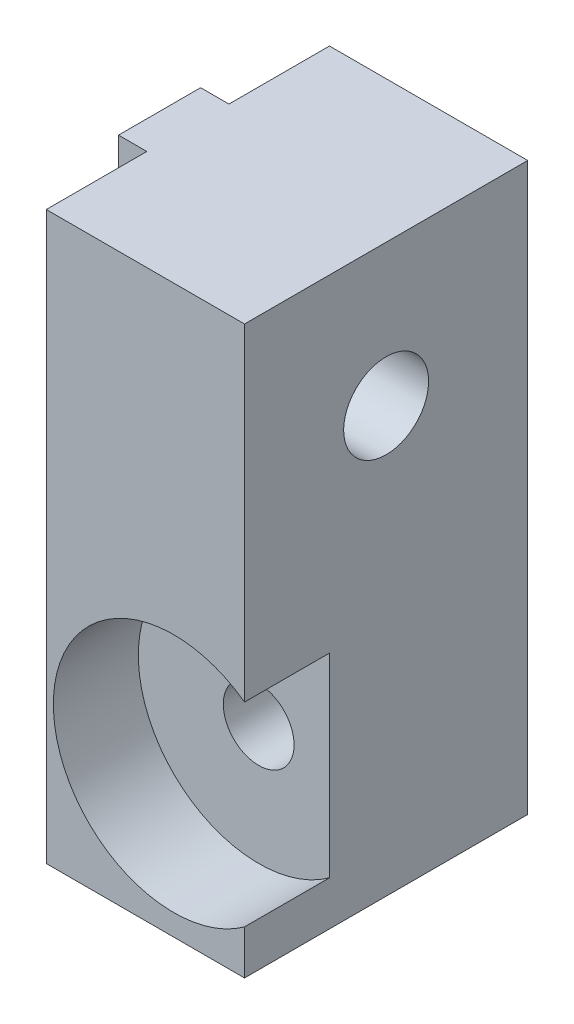
ISO-10303-21;
HEADER;
FILE_DESCRIPTION(('STEP AP214'),'2;1');
FILE_NAME('part.step','',(''),(''),'','','');
FILE_SCHEMA(('AUTOMOTIVE_DESIGN { 1 0 10303 214 1 1 1 1 }'));
ENDSEC;
DATA;
#1=APPLICATION_CONTEXT('core data for automotive mechanical design processes');
#2=APPLICATION_PROTOCOL_DEFINITION('international standard','automotive_design',2000,#1);
#3=PRODUCT_CONTEXT('',#1,'mechanical');
#4=PRODUCT('Part','Part','',(#3));
#5=PRODUCT_RELATED_PRODUCT_CATEGORY('part','',(#4));
#6=PRODUCT_DEFINITION_FORMATION('','',#4);
#7=PRODUCT_DEFINITION_CONTEXT('part definition',#1,'design');
#8=PRODUCT_DEFINITION('design','',#6,#7);
#9=PRODUCT_DEFINITION_SHAPE('','',#8);
#10=(LENGTH_UNIT() NAMED_UNIT(*) SI_UNIT(.MILLI.,.METRE.));
#11=(NAMED_UNIT(*) PLANE_ANGLE_UNIT() SI_UNIT($,.RADIAN.));
#12=(NAMED_UNIT(*) SI_UNIT($,.STERADIAN.) SOLID_ANGLE_UNIT());
#13=UNCERTAINTY_MEASURE_WITH_UNIT(LENGTH_MEASURE(1.E-05),#10,'distance_accuracy_value','');
#14=(GEOMETRIC_REPRESENTATION_CONTEXT(3) GLOBAL_UNCERTAINTY_ASSIGNED_CONTEXT((#13)) GLOBAL_UNIT_ASSIGNED_CONTEXT((#10,
#11,#12)) REPRESENTATION_CONTEXT('',''));
#15=CARTESIAN_POINT('',(0.,0.,0.));
#16=DIRECTION('',(0.,0.,1.));
#17=DIRECTION('',(1.,0.,0.));
#18=AXIS2_PLACEMENT_3D('',#15,#16,#17);
#19=CARTESIAN_POINT('',(4.5,5.,0.));
#20=DIRECTION('',(0.,0.,1.));
#21=DIRECTION('',(1.,0.,0.));
#22=AXIS2_PLACEMENT_3D('',#19,#20,#21);
#23=CYLINDRICAL_SURFACE('',#22,1.25);
#24=CARTESIAN_POINT('',(4.5,5.,0.));
#25=DIRECTION('',(0.,0.,1.));
#26=DIRECTION('',(1.,0.,0.));
#27=AXIS2_PLACEMENT_3D('',#24,#25,#26);
#28=CIRCLE('',#27,1.25);
#29=CARTESIAN_POINT('',(5.75,5.,0.));
#30=VERTEX_POINT('',#29);
#31=EDGE_CURVE('E149',#30,#30,#28,.T.);
#32=ORIENTED_EDGE('',*,*,#31,.F.);
#33=EDGE_LOOP('',(#32));
#34=FACE_BOUND('',#33,.T.);
#35=CARTESIAN_POINT('',(4.5,5.,7.));
#36=DIRECTION('',(0.,0.,1.));
#37=DIRECTION('',(1.,0.,0.));
#38=AXIS2_PLACEMENT_3D('',#35,#36,#37);
#39=CIRCLE('',#38,1.25);
#40=CARTESIAN_POINT('',(5.75,5.,7.));
#41=VERTEX_POINT('',#40);
#42=EDGE_CURVE('E37',#41,#41,#39,.F.);
#43=ORIENTED_EDGE('',*,*,#42,.F.);
#44=EDGE_LOOP('',(#43));
#45=FACE_BOUND('',#44,.T.);
#46=ADVANCED_FACE('F33',(#34,#45),#23,.F.);
#47=CARTESIAN_POINT('',(-1.,20.,3.55));
#48=DIRECTION('',(0.,0.,1.));
#49=DIRECTION('',(0.,-1.,0.));
#50=AXIS2_PLACEMENT_3D('',#47,#48,#49);
#51=PLANE('',#50);
#52=DIRECTION('',(0.,-1.,0.));
#53=VECTOR('',#52,1.);
#54=CARTESIAN_POINT('',(0.,20.,3.55));
#55=LINE('',#54,#53);
#56=CARTESIAN_POINT('',(0.,20.,3.55));
#57=VERTEX_POINT('',#56);
#58=CARTESIAN_POINT('',(0.,15.3840572873934,3.55));
#59=VERTEX_POINT('',#58);
#60=EDGE_CURVE('E214',#57,#59,#55,.T.);
#61=ORIENTED_EDGE('',*,*,#60,.T.);
#62=DIRECTION('',(-1.,0.,0.));
#63=VECTOR('',#62,1.);
#64=CARTESIAN_POINT('',(7.00000000000001,15.3840572873934,3.55));
#65=LINE('',#64,#63);
#66=CARTESIAN_POINT('',(-1.,15.3840572873934,3.55));
#67=VERTEX_POINT('',#66);
#68=EDGE_CURVE('E265',#59,#67,#65,.T.);
#69=ORIENTED_EDGE('',*,*,#68,.T.);
#70=DIRECTION('',(0.,-1.,0.));
#71=VECTOR('',#70,1.);
#72=CARTESIAN_POINT('',(-1.,20.,3.55));
#73=LINE('',#72,#71);
#74=CARTESIAN_POINT('',(-1.,20.,3.55));
#75=VERTEX_POINT('',#74);
#76=EDGE_CURVE('E267',#75,#67,#73,.T.);
#77=ORIENTED_EDGE('',*,*,#76,.F.);
#78=DIRECTION('',(1.,0.,0.));
#79=VECTOR('',#78,1.);
#80=CARTESIAN_POINT('',(-1.,20.,3.55));
#81=LINE('',#80,#79);
#82=EDGE_CURVE('E209',#75,#57,#81,.T.);
#83=ORIENTED_EDGE('',*,*,#82,.T.);
#84=EDGE_LOOP('',(#61,#69,#77,#83));
#85=FACE_BOUND('',#84,.T.);
#86=ADVANCED_FACE('F279',(#85),#51,.F.);
#87=CARTESIAN_POINT('',(-1.,20.,6.45));
#88=DIRECTION('',(0.,0.,-1.));
#89=DIRECTION('',(0.,1.,0.));
#90=AXIS2_PLACEMENT_3D('',#87,#88,#89);
#91=PLANE('',#90);
#92=DIRECTION('',(0.,1.,0.));
#93=VECTOR('',#92,1.);
#94=CARTESIAN_POINT('',(0.,20.,6.45));
#95=LINE('',#94,#93);
#96=CARTESIAN_POINT('',(0.,0.,6.45));
#97=VERTEX_POINT('',#96);
#98=CARTESIAN_POINT('',(0.,14.6159427126066,6.45));
#99=VERTEX_POINT('',#98);
#100=EDGE_CURVE('E199',#97,#99,#95,.T.);
#101=ORIENTED_EDGE('',*,*,#100,.T.);
#102=DIRECTION('',(-1.,0.,0.));
#103=VECTOR('',#102,1.);
#104=CARTESIAN_POINT('',(7.00000000000001,14.6159427126066,6.45));
#105=LINE('',#104,#103);
#106=CARTESIAN_POINT('',(-1.,14.6159427126066,6.45));
#107=VERTEX_POINT('',#106);
#108=EDGE_CURVE('E188',#99,#107,#105,.T.);
#109=ORIENTED_EDGE('',*,*,#108,.T.);
#110=DIRECTION('',(0.,1.,0.));
#111=VECTOR('',#110,1.);
#112=CARTESIAN_POINT('',(-1.,20.,6.45));
#113=LINE('',#112,#111);
#114=CARTESIAN_POINT('',(-1.,0.,6.45000000000001));
#115=VERTEX_POINT('',#114);
#116=EDGE_CURVE('E198',#115,#107,#113,.T.);
#117=ORIENTED_EDGE('',*,*,#116,.F.);
#118=DIRECTION('',(1.,0.,0.));
#119=VECTOR('',#118,1.);
#120=CARTESIAN_POINT('',(-1.,0.,6.45000000000001));
#121=LINE('',#120,#119);
#122=EDGE_CURVE('E226',#115,#97,#121,.T.);
#123=ORIENTED_EDGE('',*,*,#122,.T.);
#124=EDGE_LOOP('',(#101,#109,#117,#123));
#125=FACE_BOUND('',#124,.T.);
#126=ADVANCED_FACE('F196',(#125),#91,.F.);
#127=CARTESIAN_POINT('',(-1.,0.,0.));
#128=DIRECTION('',(-1.,0.,0.));
#129=DIRECTION('',(0.,-1.,0.));
#130=AXIS2_PLACEMENT_3D('',#127,#128,#129);
#131=PLANE('',#130);
#132=CARTESIAN_POINT('',(-1.,15.,5.));
#133=DIRECTION('',(-1.,0.,0.));
#134=DIRECTION('',(0.,-1.,0.));
#135=AXIS2_PLACEMENT_3D('',#132,#133,#134);
#136=CIRCLE('',#135,1.5);
#137=CARTESIAN_POINT('',(-1.,15.3840572873934,6.45));
#138=VERTEX_POINT('',#137);
#139=EDGE_CURVE('E11',#138,#67,#136,.T.);
#140=ORIENTED_EDGE('',*,*,#139,.F.);
#141=CARTESIAN_POINT('',(-1.,20.,6.45));
#142=VERTEX_POINT('',#141);
#143=EDGE_CURVE('E207',#138,#142,#113,.T.);
#144=ORIENTED_EDGE('',*,*,#143,.T.);
#145=DIRECTION('',(0.,0.,-1.));
#146=VECTOR('',#145,1.);
#147=CARTESIAN_POINT('',(-1.,20.,3.55));
#148=LINE('',#147,#146);
#149=EDGE_CURVE('E206',#142,#75,#148,.T.);
#150=ORIENTED_EDGE('',*,*,#149,.T.);
#151=ORIENTED_EDGE('',*,*,#76,.T.);
#152=EDGE_LOOP('',(#140,#144,#150,#151));
#153=FACE_BOUND('',#152,.T.);
#154=ADVANCED_FACE('F282',(#153),#131,.T.);
#155=CARTESIAN_POINT('',(0.,20.,10.));
#156=DIRECTION('',(1.,0.,0.));
#157=DIRECTION('',(0.,1.,0.));
#158=AXIS2_PLACEMENT_3D('',#155,#156,#157);
#159=PLANE('',#158);
#160=CARTESIAN_POINT('',(0.,14.6159427126066,3.55));
#161=VERTEX_POINT('',#160);
#162=CARTESIAN_POINT('',(0.,0.,3.55));
#163=VERTEX_POINT('',#162);
#164=EDGE_CURVE('E218',#161,#163,#55,.T.);
#165=ORIENTED_EDGE('',*,*,#164,.F.);
#166=CARTESIAN_POINT('',(0.,15.,5.));
#167=DIRECTION('',(1.,0.,0.));
#168=DIRECTION('',(0.,1.,0.));
#169=AXIS2_PLACEMENT_3D('',#166,#167,#168);
#170=CIRCLE('',#169,1.5);
#171=EDGE_CURVE('E262',#161,#59,#170,.T.);
#172=ORIENTED_EDGE('',*,*,#171,.T.);
#173=ORIENTED_EDGE('',*,*,#60,.F.);
#174=DIRECTION('',(0.,0.,-1.));
#175=VECTOR('',#174,1.);
#176=CARTESIAN_POINT('',(0.,20.,10.));
#177=LINE('',#176,#175);
#178=CARTESIAN_POINT('',(0.,20.,0.));
#179=VERTEX_POINT('',#178);
#180=EDGE_CURVE('E158',#57,#179,#177,.T.);
#181=ORIENTED_EDGE('',*,*,#180,.T.);
#182=DIRECTION('',(0.,-1.,0.));
#183=VECTOR('',#182,1.);
#184=CARTESIAN_POINT('',(0.,20.,0.));
#185=LINE('',#184,#183);
#186=CARTESIAN_POINT('',(0.,0.,0.));
#187=VERTEX_POINT('',#186);
#188=EDGE_CURVE('E163',#179,#187,#185,.T.);
#189=ORIENTED_EDGE('',*,*,#188,.T.);
#190=DIRECTION('',(0.,0.,-1.));
#191=VECTOR('',#190,1.);
#192=CARTESIAN_POINT('',(0.,0.,10.));
#193=LINE('',#192,#191);
#194=EDGE_CURVE('E183',#163,#187,#193,.T.);
#195=ORIENTED_EDGE('',*,*,#194,.F.);
#196=EDGE_LOOP('',(#165,#172,#173,#181,#189,#195));
#197=FACE_BOUND('',#196,.T.);
#198=ADVANCED_FACE('F35',(#197),#159,.F.);
#199=CARTESIAN_POINT('',(0.,15.3840572873934,6.45));
#200=VERTEX_POINT('',#199);
#201=CARTESIAN_POINT('',(0.,20.,6.45));
#202=VERTEX_POINT('',#201);
#203=EDGE_CURVE('E217',#200,#202,#95,.T.);
#204=ORIENTED_EDGE('',*,*,#203,.F.);
#205=CARTESIAN_POINT('',(0.,15.,5.));
#206=DIRECTION('',(1.,0.,0.));
#207=DIRECTION('',(0.,1.,0.));
#208=AXIS2_PLACEMENT_3D('',#205,#206,#207);
#209=CIRCLE('',#208,1.5);
#210=EDGE_CURVE('E200',#200,#99,#209,.T.);
#211=ORIENTED_EDGE('',*,*,#210,.T.);
#212=ORIENTED_EDGE('',*,*,#100,.F.);
#213=CARTESIAN_POINT('',(0.,0.,10.));
#214=VERTEX_POINT('',#213);
#215=EDGE_CURVE('E184',#214,#97,#193,.T.);
#216=ORIENTED_EDGE('',*,*,#215,.F.);
#217=DIRECTION('',(0.,-1.,0.));
#218=VECTOR('',#217,1.);
#219=CARTESIAN_POINT('',(0.,20.,10.));
#220=LINE('',#219,#218);
#221=CARTESIAN_POINT('',(0.,20.,10.));
#222=VERTEX_POINT('',#221);
#223=EDGE_CURVE('E174',#222,#214,#220,.T.);
#224=ORIENTED_EDGE('',*,*,#223,.F.);
#225=EDGE_CURVE('E175',#222,#202,#177,.T.);
#226=ORIENTED_EDGE('',*,*,#225,.T.);
#227=EDGE_LOOP('',(#204,#211,#212,#216,#224,#226));
#228=FACE_BOUND('',#227,.T.);
#229=ADVANCED_FACE('F235',(#228),#159,.F.);
#230=CARTESIAN_POINT('',(0.,0.,10.));
#231=DIRECTION('',(0.,1.,0.));
#232=DIRECTION('',(0.,0.,1.));
#233=AXIS2_PLACEMENT_3D('',#230,#231,#232);
#234=PLANE('',#233);
#235=DIRECTION('',(1.,0.,0.));
#236=VECTOR('',#235,1.);
#237=CARTESIAN_POINT('',(0.,0.,0.));
#238=LINE('',#237,#236);
#239=CARTESIAN_POINT('',(7.,0.,0.));
#240=VERTEX_POINT('',#239);
#241=EDGE_CURVE('E166',#187,#240,#238,.T.);
#242=ORIENTED_EDGE('',*,*,#241,.T.);
#243=DIRECTION('',(0.,0.,-1.));
#244=VECTOR('',#243,1.);
#245=CARTESIAN_POINT('',(7.,0.,10.));
#246=LINE('',#245,#244);
#247=CARTESIAN_POINT('',(7.,0.,10.));
#248=VERTEX_POINT('',#247);
#249=EDGE_CURVE('E181',#248,#240,#246,.T.);
#250=ORIENTED_EDGE('',*,*,#249,.F.);
#251=DIRECTION('',(1.,0.,0.));
#252=VECTOR('',#251,1.);
#253=CARTESIAN_POINT('',(0.,0.,10.));
#254=LINE('',#253,#252);
#255=EDGE_CURVE('E153',#214,#248,#254,.T.);
#256=ORIENTED_EDGE('',*,*,#255,.F.);
#257=ORIENTED_EDGE('',*,*,#215,.T.);
#258=ORIENTED_EDGE('',*,*,#122,.F.);
#259=DIRECTION('',(0.,0.,1.));
#260=VECTOR('',#259,1.);
#261=CARTESIAN_POINT('',(-1.,0.,3.55));
#262=LINE('',#261,#260);
#263=CARTESIAN_POINT('',(-1.,0.,3.55));
#264=VERTEX_POINT('',#263);
#265=EDGE_CURVE('E204',#264,#115,#262,.T.);
#266=ORIENTED_EDGE('',*,*,#265,.F.);
#267=DIRECTION('',(1.,0.,0.));
#268=VECTOR('',#267,1.);
#269=CARTESIAN_POINT('',(-1.,0.,3.55));
#270=LINE('',#269,#268);
#271=EDGE_CURVE('E167',#264,#163,#270,.T.);
#272=ORIENTED_EDGE('',*,*,#271,.T.);
#273=ORIENTED_EDGE('',*,*,#194,.T.);
#274=EDGE_LOOP('',(#242,#250,#256,#257,#258,#266,#272,#273));
#275=FACE_BOUND('',#274,.T.);
#276=ADVANCED_FACE('F237',(#275),#234,.F.);
#277=CARTESIAN_POINT('',(7.,0.,10.));
#278=DIRECTION('',(-1.,0.,0.));
#279=DIRECTION('',(0.,0.,1.));
#280=AXIS2_PLACEMENT_3D('',#277,#278,#279);
#281=PLANE('',#280);
#282=CARTESIAN_POINT('',(7.00000000000001,15.,5.));
#283=DIRECTION('',(-1.,0.,0.));
#284=DIRECTION('',(0.,-1.,0.));
#285=AXIS2_PLACEMENT_3D('',#282,#283,#284);
#286=CIRCLE('',#285,1.5);
#287=CARTESIAN_POINT('',(7.00000000000001,13.5,5.));
#288=VERTEX_POINT('',#287);
#289=EDGE_CURVE('E254',#288,#288,#286,.T.);
#290=ORIENTED_EDGE('',*,*,#289,.T.);
#291=EDGE_LOOP('',(#290));
#292=FACE_BOUND('',#291,.T.);
#293=DIRECTION('',(0.,1.,0.));
#294=VECTOR('',#293,1.);
#295=CARTESIAN_POINT('',(7.,0.,7.));
#296=LINE('',#295,#294);
#297=CARTESIAN_POINT('',(7.,1.56306822878312,7.));
#298=VERTEX_POINT('',#297);
#299=CARTESIAN_POINT('',(7.,8.43693177121688,7.));
#300=VERTEX_POINT('',#299);
#301=EDGE_CURVE('E148',#298,#300,#296,.T.);
#302=ORIENTED_EDGE('',*,*,#301,.F.);
#303=DIRECTION('',(0.,0.,1.));
#304=VECTOR('',#303,1.);
#305=CARTESIAN_POINT('',(7.,1.56306822878312,7.));
#306=LINE('',#305,#304);
#307=CARTESIAN_POINT('',(7.,1.56306822878312,10.));
#308=VERTEX_POINT('',#307);
#309=EDGE_CURVE('E135',#298,#308,#306,.T.);
#310=ORIENTED_EDGE('',*,*,#309,.T.);
#311=DIRECTION('',(0.,1.,0.));
#312=VECTOR('',#311,1.);
#313=CARTESIAN_POINT('',(7.,0.,10.));
#314=LINE('',#313,#312);
#315=EDGE_CURVE('E147',#248,#308,#314,.T.);
#316=ORIENTED_EDGE('',*,*,#315,.F.);
#317=ORIENTED_EDGE('',*,*,#249,.T.);
#318=DIRECTION('',(0.,1.,0.));
#319=VECTOR('',#318,1.);
#320=CARTESIAN_POINT('',(7.,0.,0.));
#321=LINE('',#320,#319);
#322=CARTESIAN_POINT('',(7.,20.,0.));
#323=VERTEX_POINT('',#322);
#324=EDGE_CURVE('E169',#240,#323,#321,.T.);
#325=ORIENTED_EDGE('',*,*,#324,.T.);
#326=DIRECTION('',(0.,0.,-1.));
#327=VECTOR('',#326,1.);
#328=CARTESIAN_POINT('',(7.,20.,10.));
#329=LINE('',#328,#327);
#330=CARTESIAN_POINT('',(7.,20.,10.));
#331=VERTEX_POINT('',#330);
#332=EDGE_CURVE('E178',#331,#323,#329,.T.);
#333=ORIENTED_EDGE('',*,*,#332,.F.);
#334=CARTESIAN_POINT('',(7.,8.43693177121688,10.));
#335=VERTEX_POINT('',#334);
#336=EDGE_CURVE('E156',#335,#331,#314,.T.);
#337=ORIENTED_EDGE('',*,*,#336,.F.);
#338=DIRECTION('',(0.,0.,1.));
#339=VECTOR('',#338,1.);
#340=CARTESIAN_POINT('',(7.,8.43693177121688,7.));
#341=LINE('',#340,#339);
#342=EDGE_CURVE('E49',#335,#300,#341,.F.);
#343=ORIENTED_EDGE('',*,*,#342,.T.);
#344=EDGE_LOOP('',(#302,#310,#316,#317,#325,#333,#337,#343));
#345=FACE_BOUND('',#344,.T.);
#346=ADVANCED_FACE('F145',(#292,#345),#281,.F.);
#347=CARTESIAN_POINT('',(7.,20.,10.));
#348=DIRECTION('',(0.,-1.,0.));
#349=DIRECTION('',(0.,0.,-1.));
#350=AXIS2_PLACEMENT_3D('',#347,#348,#349);
#351=PLANE('',#350);
#352=DIRECTION('',(-1.,0.,0.));
#353=VECTOR('',#352,1.);
#354=CARTESIAN_POINT('',(7.,20.,0.));
#355=LINE('',#354,#353);
#356=EDGE_CURVE('E171',#323,#179,#355,.T.);
#357=ORIENTED_EDGE('',*,*,#356,.T.);
#358=ORIENTED_EDGE('',*,*,#180,.F.);
#359=ORIENTED_EDGE('',*,*,#82,.F.);
#360=ORIENTED_EDGE('',*,*,#149,.F.);
#361=DIRECTION('',(1.,0.,0.));
#362=VECTOR('',#361,1.);
#363=CARTESIAN_POINT('',(-1.,20.,6.45));
#364=LINE('',#363,#362);
#365=EDGE_CURVE('E223',#142,#202,#364,.T.);
#366=ORIENTED_EDGE('',*,*,#365,.T.);
#367=ORIENTED_EDGE('',*,*,#225,.F.);
#368=DIRECTION('',(-1.,0.,0.));
#369=VECTOR('',#368,1.);
#370=CARTESIAN_POINT('',(7.,20.,10.));
#371=LINE('',#370,#369);
#372=EDGE_CURVE('E155',#331,#222,#371,.T.);
#373=ORIENTED_EDGE('',*,*,#372,.F.);
#374=ORIENTED_EDGE('',*,*,#332,.T.);
#375=EDGE_LOOP('',(#357,#358,#359,#360,#366,#367,#373,#374));
#376=FACE_BOUND('',#375,.T.);
#377=ADVANCED_FACE('F247',(#376),#351,.F.);
#378=CARTESIAN_POINT('',(0.,0.,10.));
#379=DIRECTION('',(0.,0.,1.));
#380=DIRECTION('',(1.,0.,0.));
#381=AXIS2_PLACEMENT_3D('',#378,#379,#380);
#382=PLANE('',#381);
#383=CARTESIAN_POINT('',(4.5,5.,10.));
#384=DIRECTION('',(0.,0.,1.));
#385=DIRECTION('',(1.,0.,0.));
#386=AXIS2_PLACEMENT_3D('',#383,#384,#385);
#387=CIRCLE('',#386,4.25);
#388=EDGE_CURVE('E132',#335,#308,#387,.T.);
#389=ORIENTED_EDGE('',*,*,#388,.F.);
#390=ORIENTED_EDGE('',*,*,#336,.T.);
#391=ORIENTED_EDGE('',*,*,#372,.T.);
#392=ORIENTED_EDGE('',*,*,#223,.T.);
#393=ORIENTED_EDGE('',*,*,#255,.T.);
#394=ORIENTED_EDGE('',*,*,#315,.T.);
#395=EDGE_LOOP('',(#389,#390,#391,#392,#393,#394));
#396=FACE_BOUND('',#395,.T.);
#397=ADVANCED_FACE('F151',(#396),#382,.T.);
#398=CARTESIAN_POINT('',(0.,0.,0.));
#399=DIRECTION('',(0.,0.,1.));
#400=DIRECTION('',(1.,0.,0.));
#401=AXIS2_PLACEMENT_3D('',#398,#399,#400);
#402=PLANE('',#401);
#403=ORIENTED_EDGE('',*,*,#31,.T.);
#404=EDGE_LOOP('',(#403));
#405=FACE_BOUND('',#404,.T.);
#406=ORIENTED_EDGE('',*,*,#188,.F.);
#407=ORIENTED_EDGE('',*,*,#356,.F.);
#408=ORIENTED_EDGE('',*,*,#324,.F.);
#409=ORIENTED_EDGE('',*,*,#241,.F.);
#410=EDGE_LOOP('',(#406,#407,#408,#409));
#411=FACE_BOUND('',#410,.T.);
#412=ADVANCED_FACE('F244',(#405,#411),#402,.F.);
#413=CARTESIAN_POINT('',(-1.,14.6159427126066,3.55));
#414=VERTEX_POINT('',#413);
#415=EDGE_CURVE('E220',#414,#264,#73,.T.);
#416=ORIENTED_EDGE('',*,*,#415,.F.);
#417=DIRECTION('',(-1.,0.,0.));
#418=VECTOR('',#417,1.);
#419=CARTESIAN_POINT('',(7.00000000000001,14.6159427126066,3.55));
#420=LINE('',#419,#418);
#421=EDGE_CURVE('E57',#414,#161,#420,.F.);
#422=ORIENTED_EDGE('',*,*,#421,.T.);
#423=ORIENTED_EDGE('',*,*,#164,.T.);
#424=ORIENTED_EDGE('',*,*,#271,.F.);
#425=EDGE_LOOP('',(#416,#422,#423,#424));
#426=FACE_BOUND('',#425,.T.);
#427=ADVANCED_FACE('F274',(#426),#51,.F.);
#428=ORIENTED_EDGE('',*,*,#143,.F.);
#429=DIRECTION('',(-1.,0.,0.));
#430=VECTOR('',#429,1.);
#431=CARTESIAN_POINT('',(7.00000000000001,15.3840572873934,6.45));
#432=LINE('',#431,#430);
#433=EDGE_CURVE('E257',#138,#200,#432,.F.);
#434=ORIENTED_EDGE('',*,*,#433,.T.);
#435=ORIENTED_EDGE('',*,*,#203,.T.);
#436=ORIENTED_EDGE('',*,*,#365,.F.);
#437=EDGE_LOOP('',(#428,#434,#435,#436));
#438=FACE_BOUND('',#437,.T.);
#439=ADVANCED_FACE('F285',(#438),#91,.F.);
#440=EDGE_CURVE('E42',#414,#107,#136,.T.);
#441=ORIENTED_EDGE('',*,*,#440,.F.);
#442=ORIENTED_EDGE('',*,*,#415,.T.);
#443=ORIENTED_EDGE('',*,*,#265,.T.);
#444=ORIENTED_EDGE('',*,*,#116,.T.);
#445=EDGE_LOOP('',(#441,#442,#443,#444));
#446=FACE_BOUND('',#445,.T.);
#447=ADVANCED_FACE('F202',(#446),#131,.T.);
#448=CARTESIAN_POINT('',(7.00000000000001,15.,5.));
#449=DIRECTION('',(-1.,0.,0.));
#450=DIRECTION('',(0.,-1.,0.));
#451=AXIS2_PLACEMENT_3D('',#448,#449,#450);
#452=CYLINDRICAL_SURFACE('',#451,1.5);
#453=ORIENTED_EDGE('',*,*,#289,.F.);
#454=EDGE_LOOP('',(#453));
#455=FACE_BOUND('',#454,.T.);
#456=ORIENTED_EDGE('',*,*,#171,.F.);
#457=ORIENTED_EDGE('',*,*,#421,.F.);
#458=ORIENTED_EDGE('',*,*,#440,.T.);
#459=ORIENTED_EDGE('',*,*,#108,.F.);
#460=ORIENTED_EDGE('',*,*,#210,.F.);
#461=ORIENTED_EDGE('',*,*,#433,.F.);
#462=ORIENTED_EDGE('',*,*,#139,.T.);
#463=ORIENTED_EDGE('',*,*,#68,.F.);
#464=EDGE_LOOP('',(#456,#457,#458,#459,#460,#461,#462,#463));
#465=FACE_BOUND('',#464,.T.);
#466=ADVANCED_FACE('F187',(#455,#465),#452,.F.);
#467=CARTESIAN_POINT('',(4.5,5.,7.));
#468=DIRECTION('',(0.,0.,1.));
#469=DIRECTION('',(1.,0.,0.));
#470=AXIS2_PLACEMENT_3D('',#467,#468,#469);
#471=CYLINDRICAL_SURFACE('',#470,4.25);
#472=CARTESIAN_POINT('',(4.5,5.,7.));
#473=DIRECTION('',(0.,0.,1.));
#474=DIRECTION('',(1.,0.,0.));
#475=AXIS2_PLACEMENT_3D('',#472,#473,#474);
#476=CIRCLE('',#475,4.25);
#477=EDGE_CURVE('E140',#300,#298,#476,.T.);
#478=ORIENTED_EDGE('',*,*,#477,.F.);
#479=ORIENTED_EDGE('',*,*,#342,.F.);
#480=ORIENTED_EDGE('',*,*,#388,.T.);
#481=ORIENTED_EDGE('',*,*,#309,.F.);
#482=EDGE_LOOP('',(#478,#479,#480,#481));
#483=FACE_BOUND('',#482,.T.);
#484=ADVANCED_FACE('F134',(#483),#471,.F.);
#485=CARTESIAN_POINT('',(4.5,5.,7.));
#486=DIRECTION('',(0.,0.,1.));
#487=DIRECTION('',(1.,0.,0.));
#488=AXIS2_PLACEMENT_3D('',#485,#486,#487);
#489=PLANE('',#488);
#490=ORIENTED_EDGE('',*,*,#42,.T.);
#491=EDGE_LOOP('',(#490));
#492=FACE_BOUND('',#491,.T.);
#493=ORIENTED_EDGE('',*,*,#301,.T.);
#494=ORIENTED_EDGE('',*,*,#477,.T.);
#495=EDGE_LOOP('',(#493,#494));
#496=FACE_BOUND('',#495,.T.);
#497=ADVANCED_FACE('F311',(#492,#496),#489,.T.);
#498=CLOSED_SHELL('',(#46,#86,#126,#154,#198,#229,#276,#346,#377,#397,#412,#427,#439,#447,#466,
#484,#497));
#499=MANIFOLD_SOLID_BREP('B2',#498);
#500=ADVANCED_BREP_SHAPE_REPRESENTATION('',(#18,#499),#14);
#501=SHAPE_DEFINITION_REPRESENTATION(#9,#500);
ENDSEC;
END-ISO-10303-21;
